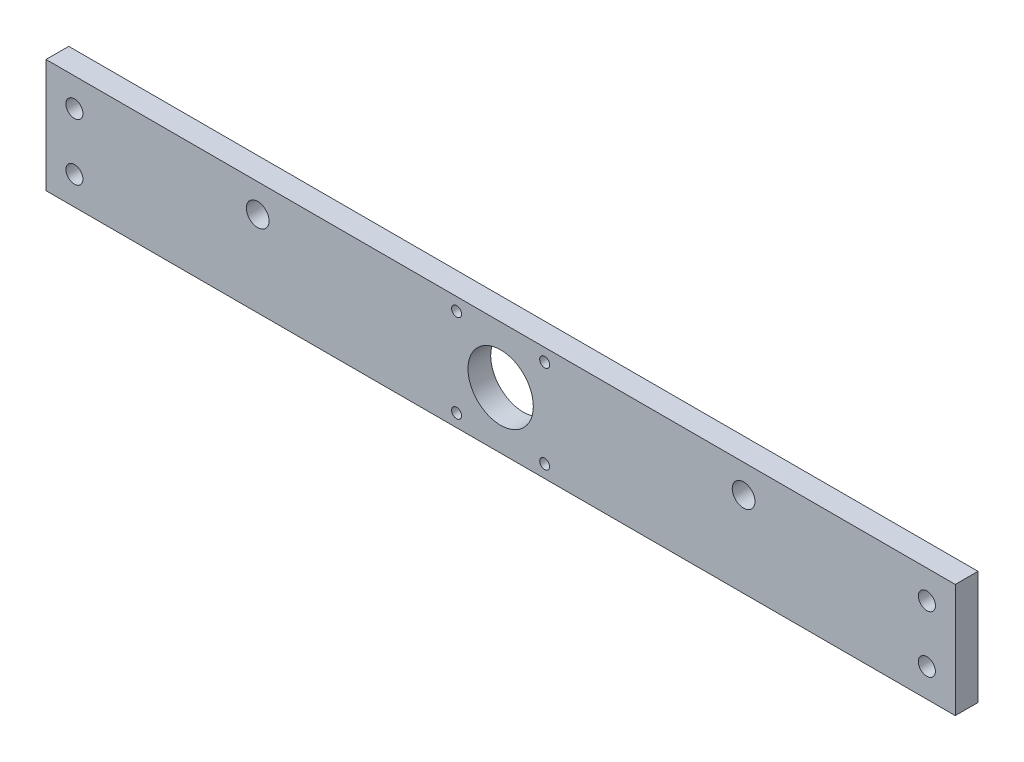
ISO-10303-21;
HEADER;
FILE_DESCRIPTION(('STEP AP214'),'2;1');
FILE_NAME('part.step','',(''),(''),'','','');
FILE_SCHEMA(('AUTOMOTIVE_DESIGN { 1 0 10303 214 1 1 1 1 }'));
ENDSEC;
DATA;
#1=APPLICATION_CONTEXT('core data for automotive mechanical design processes');
#2=APPLICATION_PROTOCOL_DEFINITION('international standard','automotive_design',2000,#1);
#3=PRODUCT_CONTEXT('',#1,'mechanical');
#4=PRODUCT('Part','Part','',(#3));
#5=PRODUCT_RELATED_PRODUCT_CATEGORY('part','',(#4));
#6=PRODUCT_DEFINITION_FORMATION('','',#4);
#7=PRODUCT_DEFINITION_CONTEXT('part definition',#1,'design');
#8=PRODUCT_DEFINITION('design','',#6,#7);
#9=PRODUCT_DEFINITION_SHAPE('','',#8);
#10=(LENGTH_UNIT() NAMED_UNIT(*) SI_UNIT(.MILLI.,.METRE.));
#11=(NAMED_UNIT(*) PLANE_ANGLE_UNIT() SI_UNIT($,.RADIAN.));
#12=(NAMED_UNIT(*) SI_UNIT($,.STERADIAN.) SOLID_ANGLE_UNIT());
#13=UNCERTAINTY_MEASURE_WITH_UNIT(LENGTH_MEASURE(1.E-05),#10,'distance_accuracy_value','');
#14=(GEOMETRIC_REPRESENTATION_CONTEXT(3) GLOBAL_UNCERTAINTY_ASSIGNED_CONTEXT((#13)) GLOBAL_UNIT_ASSIGNED_CONTEXT((#10,
#11,#12)) REPRESENTATION_CONTEXT('',''));
#15=CARTESIAN_POINT('',(0.,0.,0.));
#16=DIRECTION('',(0.,0.,1.));
#17=DIRECTION('',(1.,0.,0.));
#18=AXIS2_PLACEMENT_3D('',#15,#16,#17);
#19=CARTESIAN_POINT('',(160.,-20.,8.));
#20=DIRECTION('',(-1.,0.,0.));
#21=DIRECTION('',(0.,0.,1.));
#22=AXIS2_PLACEMENT_3D('',#19,#20,#21);
#23=PLANE('',#22);
#24=DIRECTION('',(0.,1.,0.));
#25=VECTOR('',#24,1.);
#26=CARTESIAN_POINT('',(160.,-20.,0.));
#27=LINE('',#26,#25);
#28=CARTESIAN_POINT('',(160.,-20.,0.));
#29=VERTEX_POINT('',#28);
#30=CARTESIAN_POINT('',(160.,20.,0.));
#31=VERTEX_POINT('',#30);
#32=EDGE_CURVE('E96',#29,#31,#27,.T.);
#33=ORIENTED_EDGE('',*,*,#32,.T.);
#34=DIRECTION('',(0.,0.,-1.));
#35=VECTOR('',#34,1.);
#36=CARTESIAN_POINT('',(160.,20.,8.));
#37=LINE('',#36,#35);
#38=CARTESIAN_POINT('',(160.,20.,8.));
#39=VERTEX_POINT('',#38);
#40=EDGE_CURVE('E11',#39,#31,#37,.T.);
#41=ORIENTED_EDGE('',*,*,#40,.F.);
#42=DIRECTION('',(0.,1.,0.));
#43=VECTOR('',#42,1.);
#44=CARTESIAN_POINT('',(160.,-20.,8.));
#45=LINE('',#44,#43);
#46=CARTESIAN_POINT('',(160.,-20.,8.));
#47=VERTEX_POINT('',#46);
#48=EDGE_CURVE('E84',#47,#39,#45,.T.);
#49=ORIENTED_EDGE('',*,*,#48,.F.);
#50=DIRECTION('',(0.,0.,-1.));
#51=VECTOR('',#50,1.);
#52=CARTESIAN_POINT('',(160.,-20.,8.));
#53=LINE('',#52,#51);
#54=EDGE_CURVE('E92',#47,#29,#53,.T.);
#55=ORIENTED_EDGE('',*,*,#54,.T.);
#56=EDGE_LOOP('',(#33,#41,#49,#55));
#57=FACE_BOUND('',#56,.T.);
#58=ADVANCED_FACE('F33',(#57),#23,.F.);
#59=CARTESIAN_POINT('',(-160.,20.,8.));
#60=DIRECTION('',(0.,-1.,0.));
#61=DIRECTION('',(0.,0.,-1.));
#62=AXIS2_PLACEMENT_3D('',#59,#60,#61);
#63=PLANE('',#62);
#64=DIRECTION('',(-1.,0.,0.));
#65=VECTOR('',#64,1.);
#66=CARTESIAN_POINT('',(-160.,20.,0.));
#67=LINE('',#66,#65);
#68=CARTESIAN_POINT('',(-160.,20.,0.));
#69=VERTEX_POINT('',#68);
#70=EDGE_CURVE('E88',#31,#69,#67,.T.);
#71=ORIENTED_EDGE('',*,*,#70,.T.);
#72=DIRECTION('',(0.,0.,-1.));
#73=VECTOR('',#72,1.);
#74=CARTESIAN_POINT('',(-160.,20.,8.));
#75=LINE('',#74,#73);
#76=CARTESIAN_POINT('',(-160.,20.,8.));
#77=VERTEX_POINT('',#76);
#78=EDGE_CURVE('E41',#77,#69,#75,.T.);
#79=ORIENTED_EDGE('',*,*,#78,.F.);
#80=DIRECTION('',(-1.,0.,0.));
#81=VECTOR('',#80,1.);
#82=CARTESIAN_POINT('',(-160.,20.,8.));
#83=LINE('',#82,#81);
#84=EDGE_CURVE('E79',#39,#77,#83,.T.);
#85=ORIENTED_EDGE('',*,*,#84,.F.);
#86=ORIENTED_EDGE('',*,*,#40,.T.);
#87=EDGE_LOOP('',(#71,#79,#85,#86));
#88=FACE_BOUND('',#87,.T.);
#89=ADVANCED_FACE('F87',(#88),#63,.F.);
#90=CARTESIAN_POINT('',(-160.,-20.,8.));
#91=DIRECTION('',(1.,0.,0.));
#92=DIRECTION('',(0.,0.,-1.));
#93=AXIS2_PLACEMENT_3D('',#90,#91,#92);
#94=PLANE('',#93);
#95=DIRECTION('',(0.,-1.,0.));
#96=VECTOR('',#95,1.);
#97=CARTESIAN_POINT('',(-160.,-20.,0.));
#98=LINE('',#97,#96);
#99=CARTESIAN_POINT('',(-160.,-20.,0.));
#100=VERTEX_POINT('',#99);
#101=EDGE_CURVE('E66',#69,#100,#98,.T.);
#102=ORIENTED_EDGE('',*,*,#101,.T.);
#103=DIRECTION('',(0.,0.,-1.));
#104=VECTOR('',#103,1.);
#105=CARTESIAN_POINT('',(-160.,-20.,8.));
#106=LINE('',#105,#104);
#107=CARTESIAN_POINT('',(-160.,-20.,8.));
#108=VERTEX_POINT('',#107);
#109=EDGE_CURVE('E89',#108,#100,#106,.T.);
#110=ORIENTED_EDGE('',*,*,#109,.F.);
#111=DIRECTION('',(0.,-1.,0.));
#112=VECTOR('',#111,1.);
#113=CARTESIAN_POINT('',(-160.,-20.,8.));
#114=LINE('',#113,#112);
#115=EDGE_CURVE('E82',#77,#108,#114,.T.);
#116=ORIENTED_EDGE('',*,*,#115,.F.);
#117=ORIENTED_EDGE('',*,*,#78,.T.);
#118=EDGE_LOOP('',(#102,#110,#116,#117));
#119=FACE_BOUND('',#118,.T.);
#120=ADVANCED_FACE('F90',(#119),#94,.F.);
#121=CARTESIAN_POINT('',(-160.,-20.,8.));
#122=DIRECTION('',(0.,1.,0.));
#123=DIRECTION('',(0.,0.,1.));
#124=AXIS2_PLACEMENT_3D('',#121,#122,#123);
#125=PLANE('',#124);
#126=DIRECTION('',(1.,0.,0.));
#127=VECTOR('',#126,1.);
#128=CARTESIAN_POINT('',(-160.,-20.,0.));
#129=LINE('',#128,#127);
#130=EDGE_CURVE('E72',#100,#29,#129,.T.);
#131=ORIENTED_EDGE('',*,*,#130,.T.);
#132=ORIENTED_EDGE('',*,*,#54,.F.);
#133=DIRECTION('',(1.,0.,0.));
#134=VECTOR('',#133,1.);
#135=CARTESIAN_POINT('',(-160.,-20.,8.));
#136=LINE('',#135,#134);
#137=EDGE_CURVE('E49',#108,#47,#136,.T.);
#138=ORIENTED_EDGE('',*,*,#137,.F.);
#139=ORIENTED_EDGE('',*,*,#109,.T.);
#140=EDGE_LOOP('',(#131,#132,#138,#139));
#141=FACE_BOUND('',#140,.T.);
#142=ADVANCED_FACE('F104',(#141),#125,.F.);
#143=CARTESIAN_POINT('',(0.,0.,8.));
#144=DIRECTION('',(0.,0.,-1.));
#145=DIRECTION('',(-1.,0.,0.));
#146=AXIS2_PLACEMENT_3D('',#143,#144,#145);
#147=PLANE('',#146);
#148=CARTESIAN_POINT('',(15.4999999999999,15.4999999999998,8.));
#149=DIRECTION('',(0.,0.,1.));
#150=DIRECTION('',(-1.,0.,0.));
#151=AXIS2_PLACEMENT_3D('',#148,#149,#150);
#152=CIRCLE('',#151,1.75);
#153=CARTESIAN_POINT('',(13.7499999999999,15.4999999999998,8.));
#154=VERTEX_POINT('',#153);
#155=EDGE_CURVE('E155',#154,#154,#152,.T.);
#156=ORIENTED_EDGE('',*,*,#155,.F.);
#157=EDGE_LOOP('',(#156));
#158=FACE_BOUND('',#157,.T.);
#159=CARTESIAN_POINT('',(-15.5,-15.4999999999998,8.));
#160=DIRECTION('',(0.,0.,1.));
#161=DIRECTION('',(-1.,0.,0.));
#162=AXIS2_PLACEMENT_3D('',#159,#160,#161);
#163=CIRCLE('',#162,1.75);
#164=CARTESIAN_POINT('',(-17.25,-15.4999999999998,8.));
#165=VERTEX_POINT('',#164);
#166=EDGE_CURVE('E161',#165,#165,#163,.T.);
#167=ORIENTED_EDGE('',*,*,#166,.F.);
#168=EDGE_LOOP('',(#167));
#169=FACE_BOUND('',#168,.T.);
#170=CARTESIAN_POINT('',(15.4999999999999,-15.4999999999998,8.));
#171=DIRECTION('',(0.,0.,1.));
#172=DIRECTION('',(1.,0.,0.));
#173=AXIS2_PLACEMENT_3D('',#170,#171,#172);
#174=CIRCLE('',#173,1.75);
#175=CARTESIAN_POINT('',(17.2499999999999,-15.4999999999998,8.));
#176=VERTEX_POINT('',#175);
#177=EDGE_CURVE('E162',#176,#176,#174,.T.);
#178=ORIENTED_EDGE('',*,*,#177,.F.);
#179=EDGE_LOOP('',(#178));
#180=FACE_BOUND('',#179,.T.);
#181=CARTESIAN_POINT('',(-15.5,15.4999999999998,8.));
#182=DIRECTION('',(0.,0.,1.));
#183=DIRECTION('',(1.,0.,0.));
#184=AXIS2_PLACEMENT_3D('',#181,#182,#183);
#185=CIRCLE('',#184,1.75);
#186=CARTESIAN_POINT('',(-13.75,15.4999999999998,8.));
#187=VERTEX_POINT('',#186);
#188=EDGE_CURVE('E138',#187,#187,#185,.T.);
#189=ORIENTED_EDGE('',*,*,#188,.F.);
#190=EDGE_LOOP('',(#189));
#191=FACE_BOUND('',#190,.T.);
#192=CARTESIAN_POINT('',(-85.5,9.99999999999999,8.));
#193=DIRECTION('',(0.,0.,1.));
#194=DIRECTION('',(1.,0.,0.));
#195=AXIS2_PLACEMENT_3D('',#192,#193,#194);
#196=CIRCLE('',#195,4.00000000000001);
#197=CARTESIAN_POINT('',(-81.5,9.99999999999999,8.));
#198=VERTEX_POINT('',#197);
#199=EDGE_CURVE('E120',#198,#198,#196,.T.);
#200=ORIENTED_EDGE('',*,*,#199,.F.);
#201=EDGE_LOOP('',(#200));
#202=FACE_BOUND('',#201,.T.);
#203=CARTESIAN_POINT('',(85.4999999999999,9.99999999999999,8.));
#204=DIRECTION('',(0.,0.,1.));
#205=DIRECTION('',(-1.,0.,0.));
#206=AXIS2_PLACEMENT_3D('',#203,#204,#205);
#207=CIRCLE('',#206,4.00000000000001);
#208=CARTESIAN_POINT('',(81.4999999999999,9.99999999999999,8.));
#209=VERTEX_POINT('',#208);
#210=EDGE_CURVE('E144',#209,#209,#207,.T.);
#211=ORIENTED_EDGE('',*,*,#210,.F.);
#212=EDGE_LOOP('',(#211));
#213=FACE_BOUND('',#212,.T.);
#214=CARTESIAN_POINT('',(0.,0.,8.));
#215=DIRECTION('',(0.,0.,1.));
#216=DIRECTION('',(1.,0.,0.));
#217=AXIS2_PLACEMENT_3D('',#214,#215,#216);
#218=CIRCLE('',#217,11.5);
#219=CARTESIAN_POINT('',(11.5,0.,8.));
#220=VERTEX_POINT('',#219);
#221=EDGE_CURVE('E137',#220,#220,#218,.T.);
#222=ORIENTED_EDGE('',*,*,#221,.F.);
#223=EDGE_LOOP('',(#222));
#224=FACE_BOUND('',#223,.T.);
#225=CARTESIAN_POINT('',(150.,10.,8.));
#226=DIRECTION('',(0.,0.,1.));
#227=DIRECTION('',(-1.,0.,0.));
#228=AXIS2_PLACEMENT_3D('',#225,#226,#227);
#229=CIRCLE('',#228,2.99999999999999);
#230=CARTESIAN_POINT('',(147.,10.,8.));
#231=VERTEX_POINT('',#230);
#232=EDGE_CURVE('E119',#231,#231,#229,.T.);
#233=ORIENTED_EDGE('',*,*,#232,.F.);
#234=EDGE_LOOP('',(#233));
#235=FACE_BOUND('',#234,.T.);
#236=CARTESIAN_POINT('',(150.,-9.99999999999997,8.));
#237=DIRECTION('',(0.,0.,1.));
#238=DIRECTION('',(1.,0.,0.));
#239=AXIS2_PLACEMENT_3D('',#236,#237,#238);
#240=CIRCLE('',#239,2.99999999999999);
#241=CARTESIAN_POINT('',(153.,-9.99999999999997,8.));
#242=VERTEX_POINT('',#241);
#243=EDGE_CURVE('E126',#242,#242,#240,.T.);
#244=ORIENTED_EDGE('',*,*,#243,.F.);
#245=EDGE_LOOP('',(#244));
#246=FACE_BOUND('',#245,.T.);
#247=CARTESIAN_POINT('',(-150.,-10.,8.));
#248=DIRECTION('',(0.,0.,1.));
#249=DIRECTION('',(-1.,0.,0.));
#250=AXIS2_PLACEMENT_3D('',#247,#248,#249);
#251=CIRCLE('',#250,2.99999999999999);
#252=CARTESIAN_POINT('',(-153.,-10.,8.));
#253=VERTEX_POINT('',#252);
#254=EDGE_CURVE('E113',#253,#253,#251,.T.);
#255=ORIENTED_EDGE('',*,*,#254,.F.);
#256=EDGE_LOOP('',(#255));
#257=FACE_BOUND('',#256,.T.);
#258=CARTESIAN_POINT('',(-150.,10.,8.));
#259=DIRECTION('',(0.,0.,1.));
#260=DIRECTION('',(1.,0.,0.));
#261=AXIS2_PLACEMENT_3D('',#258,#259,#260);
#262=CIRCLE('',#261,2.99999999999999);
#263=CARTESIAN_POINT('',(-147.,10.,8.));
#264=VERTEX_POINT('',#263);
#265=EDGE_CURVE('E99',#264,#264,#262,.T.);
#266=ORIENTED_EDGE('',*,*,#265,.F.);
#267=EDGE_LOOP('',(#266));
#268=FACE_BOUND('',#267,.T.);
#269=ORIENTED_EDGE('',*,*,#48,.T.);
#270=ORIENTED_EDGE('',*,*,#84,.T.);
#271=ORIENTED_EDGE('',*,*,#115,.T.);
#272=ORIENTED_EDGE('',*,*,#137,.T.);
#273=EDGE_LOOP('',(#269,#270,#271,#272));
#274=FACE_BOUND('',#273,.T.);
#275=ADVANCED_FACE('F80',(#158,#169,#180,#191,#202,#213,#224,#235,#246,#257,#268,#274),#147,.F.);
#276=CARTESIAN_POINT('',(0.,0.,0.));
#277=DIRECTION('',(0.,0.,-1.));
#278=DIRECTION('',(-1.,0.,0.));
#279=AXIS2_PLACEMENT_3D('',#276,#277,#278);
#280=PLANE('',#279);
#281=CARTESIAN_POINT('',(15.4999999999999,15.4999999999998,0.));
#282=DIRECTION('',(0.,0.,-1.));
#283=DIRECTION('',(-1.,0.,0.));
#284=AXIS2_PLACEMENT_3D('',#281,#282,#283);
#285=CIRCLE('',#284,1.75);
#286=CARTESIAN_POINT('',(13.7499999999999,15.4999999999998,0.));
#287=VERTEX_POINT('',#286);
#288=EDGE_CURVE('E165',#287,#287,#285,.F.);
#289=ORIENTED_EDGE('',*,*,#288,.T.);
#290=EDGE_LOOP('',(#289));
#291=FACE_BOUND('',#290,.T.);
#292=CARTESIAN_POINT('',(-15.5,-15.4999999999998,0.));
#293=DIRECTION('',(0.,0.,-1.));
#294=DIRECTION('',(-1.,0.,0.));
#295=AXIS2_PLACEMENT_3D('',#292,#293,#294);
#296=CIRCLE('',#295,1.75);
#297=CARTESIAN_POINT('',(-17.25,-15.4999999999998,0.));
#298=VERTEX_POINT('',#297);
#299=EDGE_CURVE('E158',#298,#298,#296,.F.);
#300=ORIENTED_EDGE('',*,*,#299,.T.);
#301=EDGE_LOOP('',(#300));
#302=FACE_BOUND('',#301,.T.);
#303=CARTESIAN_POINT('',(15.4999999999999,-15.4999999999998,0.));
#304=DIRECTION('',(0.,0.,-1.));
#305=DIRECTION('',(-1.,0.,0.));
#306=AXIS2_PLACEMENT_3D('',#303,#304,#305);
#307=CIRCLE('',#306,1.75);
#308=CARTESIAN_POINT('',(13.7499999999999,-15.4999999999998,0.));
#309=VERTEX_POINT('',#308);
#310=EDGE_CURVE('E170',#309,#309,#307,.F.);
#311=ORIENTED_EDGE('',*,*,#310,.T.);
#312=EDGE_LOOP('',(#311));
#313=FACE_BOUND('',#312,.T.);
#314=CARTESIAN_POINT('',(-15.5,15.4999999999998,0.));
#315=DIRECTION('',(0.,0.,-1.));
#316=DIRECTION('',(-1.,0.,0.));
#317=AXIS2_PLACEMENT_3D('',#314,#315,#316);
#318=CIRCLE('',#317,1.75);
#319=CARTESIAN_POINT('',(-17.25,15.4999999999998,0.));
#320=VERTEX_POINT('',#319);
#321=EDGE_CURVE('E152',#320,#320,#318,.F.);
#322=ORIENTED_EDGE('',*,*,#321,.T.);
#323=EDGE_LOOP('',(#322));
#324=FACE_BOUND('',#323,.T.);
#325=CARTESIAN_POINT('',(-85.5,9.99999999999999,0.));
#326=DIRECTION('',(0.,0.,-1.));
#327=DIRECTION('',(-1.,0.,0.));
#328=AXIS2_PLACEMENT_3D('',#325,#326,#327);
#329=CIRCLE('',#328,4.00000000000001);
#330=CARTESIAN_POINT('',(-89.5,9.99999999999999,0.));
#331=VERTEX_POINT('',#330);
#332=EDGE_CURVE('E147',#331,#331,#329,.F.);
#333=ORIENTED_EDGE('',*,*,#332,.T.);
#334=EDGE_LOOP('',(#333));
#335=FACE_BOUND('',#334,.T.);
#336=CARTESIAN_POINT('',(85.4999999999999,9.99999999999999,0.));
#337=DIRECTION('',(0.,0.,-1.));
#338=DIRECTION('',(-1.,0.,0.));
#339=AXIS2_PLACEMENT_3D('',#336,#337,#338);
#340=CIRCLE('',#339,4.00000000000001);
#341=CARTESIAN_POINT('',(81.4999999999999,9.99999999999999,0.));
#342=VERTEX_POINT('',#341);
#343=EDGE_CURVE('E141',#342,#342,#340,.F.);
#344=ORIENTED_EDGE('',*,*,#343,.T.);
#345=EDGE_LOOP('',(#344));
#346=FACE_BOUND('',#345,.T.);
#347=CARTESIAN_POINT('',(0.,0.,0.));
#348=DIRECTION('',(0.,0.,-1.));
#349=DIRECTION('',(-1.,0.,0.));
#350=AXIS2_PLACEMENT_3D('',#347,#348,#349);
#351=CIRCLE('',#350,11.5);
#352=CARTESIAN_POINT('',(-11.5,0.,0.));
#353=VERTEX_POINT('',#352);
#354=EDGE_CURVE('E134',#353,#353,#351,.F.);
#355=ORIENTED_EDGE('',*,*,#354,.T.);
#356=EDGE_LOOP('',(#355));
#357=FACE_BOUND('',#356,.T.);
#358=CARTESIAN_POINT('',(150.,10.,0.));
#359=DIRECTION('',(0.,0.,-1.));
#360=DIRECTION('',(-1.,0.,0.));
#361=AXIS2_PLACEMENT_3D('',#358,#359,#360);
#362=CIRCLE('',#361,2.99999999999999);
#363=CARTESIAN_POINT('',(147.,10.,0.));
#364=VERTEX_POINT('',#363);
#365=EDGE_CURVE('E116',#364,#364,#362,.F.);
#366=ORIENTED_EDGE('',*,*,#365,.T.);
#367=EDGE_LOOP('',(#366));
#368=FACE_BOUND('',#367,.T.);
#369=CARTESIAN_POINT('',(150.,-9.99999999999997,0.));
#370=DIRECTION('',(0.,0.,-1.));
#371=DIRECTION('',(-1.,0.,0.));
#372=AXIS2_PLACEMENT_3D('',#369,#370,#371);
#373=CIRCLE('',#372,2.99999999999999);
#374=CARTESIAN_POINT('',(147.,-9.99999999999997,0.));
#375=VERTEX_POINT('',#374);
#376=EDGE_CURVE('E123',#375,#375,#373,.F.);
#377=ORIENTED_EDGE('',*,*,#376,.T.);
#378=EDGE_LOOP('',(#377));
#379=FACE_BOUND('',#378,.T.);
#380=CARTESIAN_POINT('',(-150.,-10.,0.));
#381=DIRECTION('',(0.,0.,-1.));
#382=DIRECTION('',(-1.,0.,0.));
#383=AXIS2_PLACEMENT_3D('',#380,#381,#382);
#384=CIRCLE('',#383,2.99999999999999);
#385=CARTESIAN_POINT('',(-153.,-10.,0.));
#386=VERTEX_POINT('',#385);
#387=EDGE_CURVE('E129',#386,#386,#384,.F.);
#388=ORIENTED_EDGE('',*,*,#387,.T.);
#389=EDGE_LOOP('',(#388));
#390=FACE_BOUND('',#389,.T.);
#391=CARTESIAN_POINT('',(-150.,10.,0.));
#392=DIRECTION('',(0.,0.,-1.));
#393=DIRECTION('',(-1.,0.,0.));
#394=AXIS2_PLACEMENT_3D('',#391,#392,#393);
#395=CIRCLE('',#394,2.99999999999999);
#396=CARTESIAN_POINT('',(-153.,10.,0.));
#397=VERTEX_POINT('',#396);
#398=EDGE_CURVE('E110',#397,#397,#395,.F.);
#399=ORIENTED_EDGE('',*,*,#398,.T.);
#400=EDGE_LOOP('',(#399));
#401=FACE_BOUND('',#400,.T.);
#402=ORIENTED_EDGE('',*,*,#32,.F.);
#403=ORIENTED_EDGE('',*,*,#130,.F.);
#404=ORIENTED_EDGE('',*,*,#101,.F.);
#405=ORIENTED_EDGE('',*,*,#70,.F.);
#406=EDGE_LOOP('',(#402,#403,#404,#405));
#407=FACE_BOUND('',#406,.T.);
#408=ADVANCED_FACE('F107',(#291,#302,#313,#324,#335,#346,#357,#368,#379,#390,#401,#407),#280,.T.);
#409=CARTESIAN_POINT('',(-150.,10.,-0.000999999999999265));
#410=DIRECTION('',(0.,0.,1.));
#411=DIRECTION('',(1.,0.,0.));
#412=AXIS2_PLACEMENT_3D('',#409,#410,#411);
#413=CYLINDRICAL_SURFACE('',#412,2.99999999999999);
#414=ORIENTED_EDGE('',*,*,#398,.F.);
#415=EDGE_LOOP('',(#414));
#416=FACE_BOUND('',#415,.T.);
#417=ORIENTED_EDGE('',*,*,#265,.T.);
#418=EDGE_LOOP('',(#417));
#419=FACE_BOUND('',#418,.T.);
#420=ADVANCED_FACE('F198',(#416,#419),#413,.F.);
#421=CARTESIAN_POINT('',(-150.,-10.,-0.000999999999999265));
#422=DIRECTION('',(0.,0.,1.));
#423=DIRECTION('',(1.,0.,0.));
#424=AXIS2_PLACEMENT_3D('',#421,#422,#423);
#425=CYLINDRICAL_SURFACE('',#424,2.99999999999999);
#426=ORIENTED_EDGE('',*,*,#387,.F.);
#427=EDGE_LOOP('',(#426));
#428=FACE_BOUND('',#427,.T.);
#429=ORIENTED_EDGE('',*,*,#254,.T.);
#430=EDGE_LOOP('',(#429));
#431=FACE_BOUND('',#430,.T.);
#432=ADVANCED_FACE('F200',(#428,#431),#425,.F.);
#433=CARTESIAN_POINT('',(150.,-9.99999999999997,-0.000999999999999265));
#434=DIRECTION('',(0.,0.,1.));
#435=DIRECTION('',(1.,0.,0.));
#436=AXIS2_PLACEMENT_3D('',#433,#434,#435);
#437=CYLINDRICAL_SURFACE('',#436,2.99999999999999);
#438=ORIENTED_EDGE('',*,*,#376,.F.);
#439=EDGE_LOOP('',(#438));
#440=FACE_BOUND('',#439,.T.);
#441=ORIENTED_EDGE('',*,*,#243,.T.);
#442=EDGE_LOOP('',(#441));
#443=FACE_BOUND('',#442,.T.);
#444=ADVANCED_FACE('F207',(#440,#443),#437,.F.);
#445=CARTESIAN_POINT('',(150.,10.,-0.000999999999999265));
#446=DIRECTION('',(0.,0.,1.));
#447=DIRECTION('',(1.,0.,0.));
#448=AXIS2_PLACEMENT_3D('',#445,#446,#447);
#449=CYLINDRICAL_SURFACE('',#448,2.99999999999999);
#450=ORIENTED_EDGE('',*,*,#365,.F.);
#451=EDGE_LOOP('',(#450));
#452=FACE_BOUND('',#451,.T.);
#453=ORIENTED_EDGE('',*,*,#232,.T.);
#454=EDGE_LOOP('',(#453));
#455=FACE_BOUND('',#454,.T.);
#456=ADVANCED_FACE('F295',(#452,#455),#449,.F.);
#457=CARTESIAN_POINT('',(0.,0.,-0.000999999999999265));
#458=DIRECTION('',(0.,0.,1.));
#459=DIRECTION('',(1.,0.,0.));
#460=AXIS2_PLACEMENT_3D('',#457,#458,#459);
#461=CYLINDRICAL_SURFACE('',#460,11.5);
#462=ORIENTED_EDGE('',*,*,#354,.F.);
#463=EDGE_LOOP('',(#462));
#464=FACE_BOUND('',#463,.T.);
#465=ORIENTED_EDGE('',*,*,#221,.T.);
#466=EDGE_LOOP('',(#465));
#467=FACE_BOUND('',#466,.T.);
#468=ADVANCED_FACE('F292',(#464,#467),#461,.F.);
#469=CARTESIAN_POINT('',(85.4999999999999,9.99999999999999,-0.000999999999999265));
#470=DIRECTION('',(0.,0.,1.));
#471=DIRECTION('',(1.,0.,0.));
#472=AXIS2_PLACEMENT_3D('',#469,#470,#471);
#473=CYLINDRICAL_SURFACE('',#472,4.00000000000001);
#474=ORIENTED_EDGE('',*,*,#343,.F.);
#475=EDGE_LOOP('',(#474));
#476=FACE_BOUND('',#475,.T.);
#477=ORIENTED_EDGE('',*,*,#210,.T.);
#478=EDGE_LOOP('',(#477));
#479=FACE_BOUND('',#478,.T.);
#480=ADVANCED_FACE('F288',(#476,#479),#473,.F.);
#481=CARTESIAN_POINT('',(-85.5,9.99999999999999,-0.000999999999999265));
#482=DIRECTION('',(0.,0.,1.));
#483=DIRECTION('',(1.,0.,0.));
#484=AXIS2_PLACEMENT_3D('',#481,#482,#483);
#485=CYLINDRICAL_SURFACE('',#484,4.00000000000001);
#486=ORIENTED_EDGE('',*,*,#332,.F.);
#487=EDGE_LOOP('',(#486));
#488=FACE_BOUND('',#487,.T.);
#489=ORIENTED_EDGE('',*,*,#199,.T.);
#490=EDGE_LOOP('',(#489));
#491=FACE_BOUND('',#490,.T.);
#492=ADVANCED_FACE('F248',(#488,#491),#485,.F.);
#493=CARTESIAN_POINT('',(-15.5,15.4999999999998,-0.000999999999999265));
#494=DIRECTION('',(0.,0.,1.));
#495=DIRECTION('',(1.,0.,0.));
#496=AXIS2_PLACEMENT_3D('',#493,#494,#495);
#497=CYLINDRICAL_SURFACE('',#496,1.75);
#498=ORIENTED_EDGE('',*,*,#321,.F.);
#499=EDGE_LOOP('',(#498));
#500=FACE_BOUND('',#499,.T.);
#501=ORIENTED_EDGE('',*,*,#188,.T.);
#502=EDGE_LOOP('',(#501));
#503=FACE_BOUND('',#502,.T.);
#504=ADVANCED_FACE('F243',(#500,#503),#497,.F.);
#505=CARTESIAN_POINT('',(15.4999999999999,-15.4999999999998,-0.000999999999999265));
#506=DIRECTION('',(0.,0.,1.));
#507=DIRECTION('',(1.,0.,0.));
#508=AXIS2_PLACEMENT_3D('',#505,#506,#507);
#509=CYLINDRICAL_SURFACE('',#508,1.75);
#510=ORIENTED_EDGE('',*,*,#310,.F.);
#511=EDGE_LOOP('',(#510));
#512=FACE_BOUND('',#511,.T.);
#513=ORIENTED_EDGE('',*,*,#177,.T.);
#514=EDGE_LOOP('',(#513));
#515=FACE_BOUND('',#514,.T.);
#516=ADVANCED_FACE('F176',(#512,#515),#509,.F.);
#517=CARTESIAN_POINT('',(-15.5,-15.4999999999998,-0.000999999999999265));
#518=DIRECTION('',(0.,0.,1.));
#519=DIRECTION('',(1.,0.,0.));
#520=AXIS2_PLACEMENT_3D('',#517,#518,#519);
#521=CYLINDRICAL_SURFACE('',#520,1.75);
#522=ORIENTED_EDGE('',*,*,#299,.F.);
#523=EDGE_LOOP('',(#522));
#524=FACE_BOUND('',#523,.T.);
#525=ORIENTED_EDGE('',*,*,#166,.T.);
#526=EDGE_LOOP('',(#525));
#527=FACE_BOUND('',#526,.T.);
#528=ADVANCED_FACE('F260',(#524,#527),#521,.F.);
#529=CARTESIAN_POINT('',(15.4999999999999,15.4999999999998,-0.000999999999999265));
#530=DIRECTION('',(0.,0.,1.));
#531=DIRECTION('',(1.,0.,0.));
#532=AXIS2_PLACEMENT_3D('',#529,#530,#531);
#533=CYLINDRICAL_SURFACE('',#532,1.75);
#534=ORIENTED_EDGE('',*,*,#288,.F.);
#535=EDGE_LOOP('',(#534));
#536=FACE_BOUND('',#535,.T.);
#537=ORIENTED_EDGE('',*,*,#155,.T.);
#538=EDGE_LOOP('',(#537));
#539=FACE_BOUND('',#538,.T.);
#540=ADVANCED_FACE('F270',(#536,#539),#533,.F.);
#541=CLOSED_SHELL('',(#58,#89,#120,#142,#275,#408,#420,#432,#444,#456,#468,#480,#492,#504,#516,
#528,#540));
#542=MANIFOLD_SOLID_BREP('B2',#541);
#543=ADVANCED_BREP_SHAPE_REPRESENTATION('',(#18,#542),#14);
#544=SHAPE_DEFINITION_REPRESENTATION(#9,#543);
ENDSEC;
END-ISO-10303-21;
